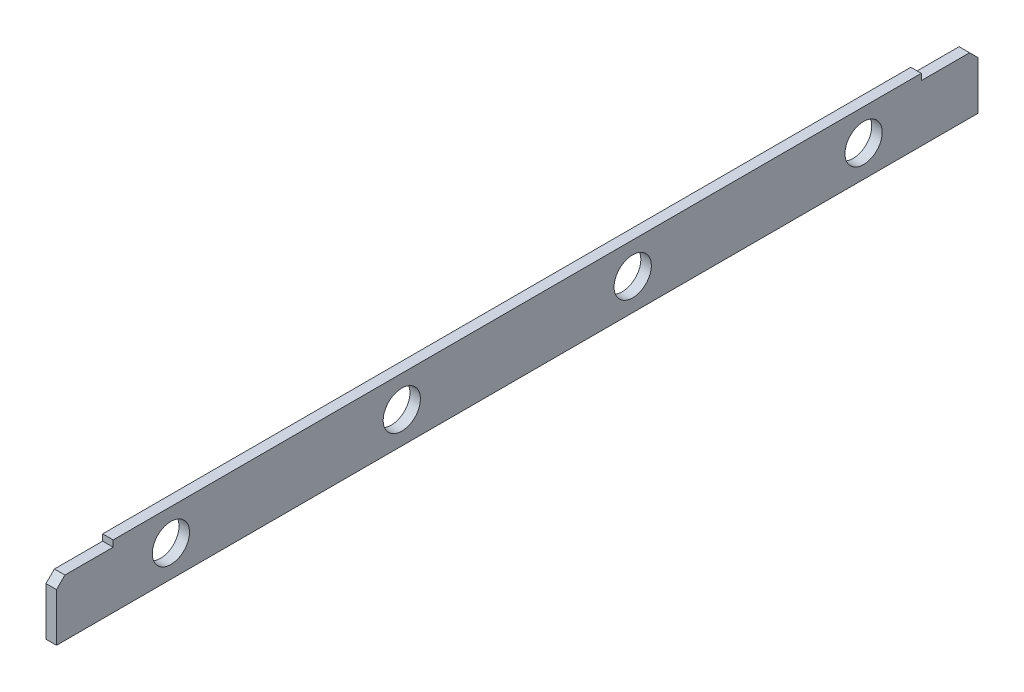
ISO-10303-21;
HEADER;
FILE_DESCRIPTION(('STEP AP214'),'2;1');
FILE_NAME('part.step','',(''),(''),'','','');
FILE_SCHEMA(('AUTOMOTIVE_DESIGN { 1 0 10303 214 1 1 1 1 }'));
ENDSEC;
DATA;
#1=APPLICATION_CONTEXT('core data for automotive mechanical design processes');
#2=APPLICATION_PROTOCOL_DEFINITION('international standard','automotive_design',2000,#1);
#3=PRODUCT_CONTEXT('',#1,'mechanical');
#4=PRODUCT('Part','Part','',(#3));
#5=PRODUCT_RELATED_PRODUCT_CATEGORY('part','',(#4));
#6=PRODUCT_DEFINITION_FORMATION('','',#4);
#7=PRODUCT_DEFINITION_CONTEXT('part definition',#1,'design');
#8=PRODUCT_DEFINITION('design','',#6,#7);
#9=PRODUCT_DEFINITION_SHAPE('','',#8);
#10=(LENGTH_UNIT() NAMED_UNIT(*) SI_UNIT(.MILLI.,.METRE.));
#11=(NAMED_UNIT(*) PLANE_ANGLE_UNIT() SI_UNIT($,.RADIAN.));
#12=(NAMED_UNIT(*) SI_UNIT($,.STERADIAN.) SOLID_ANGLE_UNIT());
#13=UNCERTAINTY_MEASURE_WITH_UNIT(LENGTH_MEASURE(1.E-05),#10,'distance_accuracy_value','');
#14=(GEOMETRIC_REPRESENTATION_CONTEXT(3) GLOBAL_UNCERTAINTY_ASSIGNED_CONTEXT((#13)) GLOBAL_UNIT_ASSIGNED_CONTEXT((#10,
#11,#12)) REPRESENTATION_CONTEXT('',''));
#15=CARTESIAN_POINT('',(0.,0.,0.));
#16=DIRECTION('',(0.,0.,1.));
#17=DIRECTION('',(1.,0.,0.));
#18=AXIS2_PLACEMENT_3D('',#15,#16,#17);
#19=CARTESIAN_POINT('',(0.,-60.0000000000011,445.));
#20=DIRECTION('',(1.,0.,0.));
#21=DIRECTION('',(0.,0.,-1.));
#22=AXIS2_PLACEMENT_3D('',#19,#20,#21);
#23=PLANE('',#22);
#24=CARTESIAN_POINT('',(0.,-30.0000000000142,330.));
#25=DIRECTION('',(1.,0.,0.));
#26=DIRECTION('',(0.,0.,-1.));
#27=AXIS2_PLACEMENT_3D('',#24,#25,#26);
#28=CIRCLE('',#27,17.75);
#29=CARTESIAN_POINT('',(0.,-30.0000000000142,312.25));
#30=VERTEX_POINT('',#29);
#31=EDGE_CURVE('E187',#30,#30,#28,.T.);
#32=ORIENTED_EDGE('',*,*,#31,.T.);
#33=EDGE_LOOP('',(#32));
#34=FACE_BOUND('',#33,.T.);
#35=CARTESIAN_POINT('',(0.,-30.0000000000142,110.));
#36=DIRECTION('',(1.,0.,0.));
#37=DIRECTION('',(0.,0.,-1.));
#38=AXIS2_PLACEMENT_3D('',#35,#36,#37);
#39=CIRCLE('',#38,17.75);
#40=CARTESIAN_POINT('',(0.,-30.0000000000142,92.2499999999998));
#41=VERTEX_POINT('',#40);
#42=EDGE_CURVE('E183',#41,#41,#39,.T.);
#43=ORIENTED_EDGE('',*,*,#42,.T.);
#44=EDGE_LOOP('',(#43));
#45=FACE_BOUND('',#44,.T.);
#46=CARTESIAN_POINT('',(0.,-30.000000000014,-110.));
#47=DIRECTION('',(1.,0.,0.));
#48=DIRECTION('',(0.,0.,-1.));
#49=AXIS2_PLACEMENT_3D('',#46,#47,#48);
#50=CIRCLE('',#49,17.75);
#51=CARTESIAN_POINT('',(0.,-30.000000000014,-127.75));
#52=VERTEX_POINT('',#51);
#53=EDGE_CURVE('E179',#52,#52,#50,.T.);
#54=ORIENTED_EDGE('',*,*,#53,.T.);
#55=EDGE_LOOP('',(#54));
#56=FACE_BOUND('',#55,.T.);
#57=CARTESIAN_POINT('',(-1.07552855510562E-13,-30.0000000000145,-330.000000000001));
#58=DIRECTION('',(1.,0.,0.));
#59=DIRECTION('',(0.,0.,-1.));
#60=AXIS2_PLACEMENT_3D('',#57,#58,#59);
#61=CIRCLE('',#60,17.75);
#62=CARTESIAN_POINT('',(-1.09511055020338E-13,-30.0000000000145,-347.750000000001));
#63=VERTEX_POINT('',#62);
#64=EDGE_CURVE('E178',#63,#63,#61,.T.);
#65=ORIENTED_EDGE('',*,*,#64,.T.);
#66=EDGE_LOOP('',(#65));
#67=FACE_BOUND('',#66,.T.);
#68=DIRECTION('',(0.,1.,0.));
#69=VECTOR('',#68,1.);
#70=CARTESIAN_POINT('',(0.,-60.0000000000093,-439.));
#71=LINE('',#70,#69);
#72=CARTESIAN_POINT('',(-3.38271077815477E-12,-60.0000000000002,-438.999999999999));
#73=VERTEX_POINT('',#72);
#74=CARTESIAN_POINT('',(0.,-13.9999999999999,-439.));
#75=VERTEX_POINT('',#74);
#76=EDGE_CURVE('E129',#73,#75,#71,.T.);
#77=ORIENTED_EDGE('',*,*,#76,.F.);
#78=DIRECTION('',(0.,0.,-1.));
#79=VECTOR('',#78,1.);
#80=CARTESIAN_POINT('',(0.,-60.0000000000011,445.));
#81=LINE('',#80,#79);
#82=CARTESIAN_POINT('',(0.,-60.0000000000003,439.000000000002));
#83=VERTEX_POINT('',#82);
#84=EDGE_CURVE('E159',#83,#73,#81,.T.);
#85=ORIENTED_EDGE('',*,*,#84,.F.);
#86=DIRECTION('',(0.,-0.999999999999999,0.));
#87=VECTOR('',#86,1.);
#88=CARTESIAN_POINT('',(0.,-60.0000000000012,439.000000000001));
#89=LINE('',#88,#87);
#90=CARTESIAN_POINT('',(0.,-14.0000000000001,439.));
#91=VERTEX_POINT('',#90);
#92=EDGE_CURVE('E213',#91,#83,#89,.T.);
#93=ORIENTED_EDGE('',*,*,#92,.F.);
#94=DIRECTION('',(0.,0.707106781186543,-0.707106781186552));
#95=VECTOR('',#94,1.);
#96=CARTESIAN_POINT('',(0.,-40.0000000000008,465.000000000001));
#97=LINE('',#96,#95);
#98=CARTESIAN_POINT('',(0.,-6.00000000000012,431.));
#99=VERTEX_POINT('',#98);
#100=EDGE_CURVE('E169',#91,#99,#97,.T.);
#101=ORIENTED_EDGE('',*,*,#100,.T.);
#102=DIRECTION('',(0.,0.,1.));
#103=VECTOR('',#102,1.);
#104=CARTESIAN_POINT('',(0.,-6.00000000000001,445.));
#105=LINE('',#104,#103);
#106=CARTESIAN_POINT('',(0.,-6.000000000001,385.));
#107=VERTEX_POINT('',#106);
#108=EDGE_CURVE('E221',#107,#99,#105,.T.);
#109=ORIENTED_EDGE('',*,*,#108,.F.);
#110=DIRECTION('',(0.,-0.999999999999999,0.));
#111=VECTOR('',#110,1.);
#112=CARTESIAN_POINT('',(0.,-60.0000000000015,385.000000000001));
#113=LINE('',#112,#111);
#114=CARTESIAN_POINT('',(0.,0.,385.));
#115=VERTEX_POINT('',#114);
#116=EDGE_CURVE('E225',#115,#107,#113,.T.);
#117=ORIENTED_EDGE('',*,*,#116,.F.);
#118=DIRECTION('',(0.,0.,-1.));
#119=VECTOR('',#118,1.);
#120=CARTESIAN_POINT('',(0.,0.,445.));
#121=LINE('',#120,#119);
#122=CARTESIAN_POINT('',(-3.43822192938603E-12,6.66133814775094E-13,-385.));
#123=VERTEX_POINT('',#122);
#124=EDGE_CURVE('E164',#115,#123,#121,.T.);
#125=ORIENTED_EDGE('',*,*,#124,.T.);
#126=DIRECTION('',(0.,1.,0.));
#127=VECTOR('',#126,1.);
#128=CARTESIAN_POINT('',(0.,-60.0000000000241,-384.999999999999));
#129=LINE('',#128,#127);
#130=CARTESIAN_POINT('',(-1.07552855510562E-13,-6.00000000000001,-385.));
#131=VERTEX_POINT('',#130);
#132=EDGE_CURVE('E156',#131,#123,#129,.T.);
#133=ORIENTED_EDGE('',*,*,#132,.F.);
#134=DIRECTION('',(0.,0.,1.));
#135=VECTOR('',#134,1.);
#136=CARTESIAN_POINT('',(0.,-5.99999999999046,445.000000000001));
#137=LINE('',#136,#135);
#138=CARTESIAN_POINT('',(-1.11022302462516E-13,-5.99999999999989,-431.));
#139=VERTEX_POINT('',#138);
#140=EDGE_CURVE('E145',#139,#131,#137,.T.);
#141=ORIENTED_EDGE('',*,*,#140,.F.);
#142=DIRECTION('',(0.,-0.707106781186554,-0.70710678118654));
#143=VECTOR('',#142,1.);
#144=CARTESIAN_POINT('',(0.,404.999999999999,-20.0000000000096));
#145=LINE('',#144,#143);
#146=EDGE_CURVE('E168',#139,#75,#145,.T.);
#147=ORIENTED_EDGE('',*,*,#146,.T.);
#148=EDGE_LOOP('',(#77,#85,#93,#101,#109,#117,#125,#133,#141,#147));
#149=FACE_BOUND('',#148,.T.);
#150=ADVANCED_FACE('F40',(#34,#45,#56,#67,#149),#23,.F.);
#151=CARTESIAN_POINT('',(0.,0.,445.));
#152=DIRECTION('',(0.,-0.999999999999999,0.));
#153=DIRECTION('',(0.,0.,-0.999999999999999));
#154=AXIS2_PLACEMENT_3D('',#151,#152,#153);
#155=PLANE('',#154);
#156=DIRECTION('',(1.,0.,0.));
#157=VECTOR('',#156,1.);
#158=CARTESIAN_POINT('',(-600.,1.22124532708767E-12,-385.));
#159=LINE('',#158,#157);
#160=CARTESIAN_POINT('',(9.9999999999999,6.66133814775094E-13,-385.));
#161=VERTEX_POINT('',#160);
#162=EDGE_CURVE('E152',#123,#161,#159,.T.);
#163=ORIENTED_EDGE('',*,*,#162,.F.);
#164=ORIENTED_EDGE('',*,*,#124,.F.);
#165=DIRECTION('',(1.,0.,0.));
#166=VECTOR('',#165,1.);
#167=CARTESIAN_POINT('',(-600.,-3.33066907387547E-13,385.));
#168=LINE('',#167,#166);
#169=CARTESIAN_POINT('',(10.0000000000005,-5.55111512312578E-13,384.999999999999));
#170=VERTEX_POINT('',#169);
#171=EDGE_CURVE('E163',#115,#170,#168,.T.);
#172=ORIENTED_EDGE('',*,*,#171,.T.);
#173=DIRECTION('',(0.,0.,-1.));
#174=VECTOR('',#173,1.);
#175=CARTESIAN_POINT('',(10.,-1.11022302462516E-13,445.));
#176=LINE('',#175,#174);
#177=EDGE_CURVE('E126',#170,#161,#176,.T.);
#178=ORIENTED_EDGE('',*,*,#177,.T.);
#179=EDGE_LOOP('',(#163,#164,#172,#178));
#180=FACE_BOUND('',#179,.T.);
#181=ADVANCED_FACE('F269',(#180),#155,.F.);
#182=CARTESIAN_POINT('',(9.99999999999995,-60.0000000000009,445.));
#183=DIRECTION('',(-1.,0.,0.));
#184=DIRECTION('',(0.,0.,1.));
#185=AXIS2_PLACEMENT_3D('',#182,#183,#184);
#186=PLANE('',#185);
#187=CARTESIAN_POINT('',(10.,-30.0000000000142,330.));
#188=DIRECTION('',(-1.,0.,0.));
#189=DIRECTION('',(0.,0.,1.));
#190=AXIS2_PLACEMENT_3D('',#187,#188,#189);
#191=CIRCLE('',#190,17.75);
#192=CARTESIAN_POINT('',(10.,-30.0000000000142,347.75));
#193=VERTEX_POINT('',#192);
#194=EDGE_CURVE('E43',#193,#193,#191,.T.);
#195=ORIENTED_EDGE('',*,*,#194,.T.);
#196=EDGE_LOOP('',(#195));
#197=FACE_BOUND('',#196,.T.);
#198=CARTESIAN_POINT('',(10.,-30.0000000000147,110.));
#199=DIRECTION('',(-1.,0.,0.));
#200=DIRECTION('',(0.,0.,1.));
#201=AXIS2_PLACEMENT_3D('',#198,#199,#200);
#202=CIRCLE('',#201,17.75);
#203=CARTESIAN_POINT('',(10.,-30.0000000000147,127.75));
#204=VERTEX_POINT('',#203);
#205=EDGE_CURVE('E184',#204,#204,#202,.T.);
#206=ORIENTED_EDGE('',*,*,#205,.T.);
#207=EDGE_LOOP('',(#206));
#208=FACE_BOUND('',#207,.T.);
#209=CARTESIAN_POINT('',(9.9999999999999,-30.0000000000141,-110.));
#210=DIRECTION('',(-1.,0.,0.));
#211=DIRECTION('',(0.,0.,1.));
#212=AXIS2_PLACEMENT_3D('',#209,#210,#211);
#213=CIRCLE('',#212,17.75);
#214=CARTESIAN_POINT('',(9.9999999999999,-30.0000000000141,-92.2500000000003));
#215=VERTEX_POINT('',#214);
#216=EDGE_CURVE('E180',#215,#215,#213,.T.);
#217=ORIENTED_EDGE('',*,*,#216,.T.);
#218=EDGE_LOOP('',(#217));
#219=FACE_BOUND('',#218,.T.);
#220=CARTESIAN_POINT('',(9.9999999999999,-30.0000000000145,-330.000000000001));
#221=DIRECTION('',(-1.,0.,0.));
#222=DIRECTION('',(0.,0.,1.));
#223=AXIS2_PLACEMENT_3D('',#220,#221,#222);
#224=CIRCLE('',#223,17.75);
#225=CARTESIAN_POINT('',(9.9999999999999,-30.0000000000145,-312.250000000001));
#226=VERTEX_POINT('',#225);
#227=EDGE_CURVE('E174',#226,#226,#224,.T.);
#228=ORIENTED_EDGE('',*,*,#227,.T.);
#229=EDGE_LOOP('',(#228));
#230=FACE_BOUND('',#229,.T.);
#231=DIRECTION('',(0.,-1.,0.));
#232=VECTOR('',#231,1.);
#233=CARTESIAN_POINT('',(9.99999999999985,-60.0000000000098,-439.));
#234=LINE('',#233,#232);
#235=CARTESIAN_POINT('',(9.9999999999999,-13.9999999999999,-439.));
#236=VERTEX_POINT('',#235);
#237=CARTESIAN_POINT('',(9.9999999999999,-60.0000000000017,-439.));
#238=VERTEX_POINT('',#237);
#239=EDGE_CURVE('E49',#236,#238,#234,.T.);
#240=ORIENTED_EDGE('',*,*,#239,.F.);
#241=DIRECTION('',(0.,0.707106781186554,0.70710678118654));
#242=VECTOR('',#241,1.);
#243=CARTESIAN_POINT('',(9.99999999999993,404.999999999999,-20.0000000000095));
#244=LINE('',#243,#242);
#245=CARTESIAN_POINT('',(9.9999999999999,-5.99999999999989,-431.));
#246=VERTEX_POINT('',#245);
#247=EDGE_CURVE('E116',#236,#246,#244,.T.);
#248=ORIENTED_EDGE('',*,*,#247,.T.);
#249=DIRECTION('',(0.,0.,-1.));
#250=VECTOR('',#249,1.);
#251=CARTESIAN_POINT('',(10.,-5.99999999999046,444.999999999999));
#252=LINE('',#251,#250);
#253=CARTESIAN_POINT('',(9.99999999999993,-5.99999999999989,-385.));
#254=VERTEX_POINT('',#253);
#255=EDGE_CURVE('E151',#254,#246,#252,.T.);
#256=ORIENTED_EDGE('',*,*,#255,.F.);
#257=DIRECTION('',(0.,-1.,0.));
#258=VECTOR('',#257,1.);
#259=CARTESIAN_POINT('',(10.,-60.0000000000241,-384.999999999998));
#260=LINE('',#259,#258);
#261=EDGE_CURVE('E155',#161,#254,#260,.T.);
#262=ORIENTED_EDGE('',*,*,#261,.F.);
#263=ORIENTED_EDGE('',*,*,#177,.F.);
#264=DIRECTION('',(0.,0.999999999999999,0.));
#265=VECTOR('',#264,1.);
#266=CARTESIAN_POINT('',(9.99999999999997,-60.0000000000016,385.));
#267=LINE('',#266,#265);
#268=CARTESIAN_POINT('',(9.99999999999998,-6.000000000001,385.));
#269=VERTEX_POINT('',#268);
#270=EDGE_CURVE('E173',#269,#170,#267,.T.);
#271=ORIENTED_EDGE('',*,*,#270,.F.);
#272=DIRECTION('',(0.,0.,-1.));
#273=VECTOR('',#272,1.);
#274=CARTESIAN_POINT('',(10.,-6.00000000000001,445.));
#275=LINE('',#274,#273);
#276=CARTESIAN_POINT('',(9.99999999999998,-6.00000000000023,430.999999999999));
#277=VERTEX_POINT('',#276);
#278=EDGE_CURVE('E224',#277,#269,#275,.T.);
#279=ORIENTED_EDGE('',*,*,#278,.F.);
#280=DIRECTION('',(0.,-0.707106781186543,0.707106781186552));
#281=VECTOR('',#280,1.);
#282=CARTESIAN_POINT('',(9.99999999999999,-40.0000000000008,465.000000000001));
#283=LINE('',#282,#281);
#284=CARTESIAN_POINT('',(9.99999999999998,-14.0000000000001,439.));
#285=VERTEX_POINT('',#284);
#286=EDGE_CURVE('E125',#277,#285,#283,.T.);
#287=ORIENTED_EDGE('',*,*,#286,.T.);
#288=DIRECTION('',(0.,0.999999999999999,0.));
#289=VECTOR('',#288,1.);
#290=CARTESIAN_POINT('',(9.99999999999997,-60.0000000000013,439.000000000001));
#291=LINE('',#290,#289);
#292=CARTESIAN_POINT('',(9.99999999999999,-60.0000000000004,439.000000000001));
#293=VERTEX_POINT('',#292);
#294=EDGE_CURVE('E217',#293,#285,#291,.T.);
#295=ORIENTED_EDGE('',*,*,#294,.F.);
#296=DIRECTION('',(0.,0.,-1.));
#297=VECTOR('',#296,1.);
#298=CARTESIAN_POINT('',(9.99999999999995,-60.0000000000009,445.));
#299=LINE('',#298,#297);
#300=EDGE_CURVE('E136',#293,#238,#299,.T.);
#301=ORIENTED_EDGE('',*,*,#300,.T.);
#302=EDGE_LOOP('',(#240,#248,#256,#262,#263,#271,#279,#287,#295,#301));
#303=FACE_BOUND('',#302,.T.);
#304=ADVANCED_FACE('F133',(#197,#208,#219,#230,#303),#186,.F.);
#305=CARTESIAN_POINT('',(9.99999999999995,-60.0000000000009,445.));
#306=DIRECTION('',(0.,0.999999999999999,0.));
#307=DIRECTION('',(0.,0.,0.999999999999999));
#308=AXIS2_PLACEMENT_3D('',#305,#306,#307);
#309=PLANE('',#308);
#310=DIRECTION('',(-1.,0.,0.));
#311=VECTOR('',#310,1.);
#312=CARTESIAN_POINT('',(9.9999999999999,-60.0000000000017,-439.));
#313=LINE('',#312,#311);
#314=EDGE_CURVE('E11',#238,#73,#313,.T.);
#315=ORIENTED_EDGE('',*,*,#314,.F.);
#316=ORIENTED_EDGE('',*,*,#300,.F.);
#317=DIRECTION('',(1.,0.,0.));
#318=VECTOR('',#317,1.);
#319=CARTESIAN_POINT('',(-600.,-60.0000000000003,439.));
#320=LINE('',#319,#318);
#321=EDGE_CURVE('E216',#83,#293,#320,.T.);
#322=ORIENTED_EDGE('',*,*,#321,.F.);
#323=ORIENTED_EDGE('',*,*,#84,.T.);
#324=EDGE_LOOP('',(#315,#316,#322,#323));
#325=FACE_BOUND('',#324,.T.);
#326=ADVANCED_FACE('F287',(#325),#309,.F.);
#327=CARTESIAN_POINT('',(-600.,-2.00000000000033,385.));
#328=DIRECTION('',(0.,0.,1.));
#329=DIRECTION('',(0.,-0.999999999999999,0.));
#330=AXIS2_PLACEMENT_3D('',#327,#328,#329);
#331=PLANE('',#330);
#332=ORIENTED_EDGE('',*,*,#270,.T.);
#333=ORIENTED_EDGE('',*,*,#171,.F.);
#334=ORIENTED_EDGE('',*,*,#116,.T.);
#335=DIRECTION('',(1.,0.,0.));
#336=VECTOR('',#335,1.);
#337=CARTESIAN_POINT('',(-600.,-6.00000000000056,385.));
#338=LINE('',#337,#336);
#339=EDGE_CURVE('E228',#107,#269,#338,.T.);
#340=ORIENTED_EDGE('',*,*,#339,.T.);
#341=EDGE_LOOP('',(#332,#333,#334,#340));
#342=FACE_BOUND('',#341,.T.);
#343=ADVANCED_FACE('F275',(#342),#331,.T.);
#344=CARTESIAN_POINT('',(-600.,-56.,439.000000000001));
#345=DIRECTION('',(0.,0.,1.));
#346=DIRECTION('',(0.,-0.999999999999999,0.));
#347=AXIS2_PLACEMENT_3D('',#344,#345,#346);
#348=PLANE('',#347);
#349=ORIENTED_EDGE('',*,*,#294,.T.);
#350=DIRECTION('',(1.,0.,0.));
#351=VECTOR('',#350,1.);
#352=CARTESIAN_POINT('',(-600.,-14.,439.));
#353=LINE('',#352,#351);
#354=EDGE_CURVE('E231',#91,#285,#353,.T.);
#355=ORIENTED_EDGE('',*,*,#354,.F.);
#356=ORIENTED_EDGE('',*,*,#92,.T.);
#357=ORIENTED_EDGE('',*,*,#321,.T.);
#358=EDGE_LOOP('',(#349,#355,#356,#357));
#359=FACE_BOUND('',#358,.T.);
#360=ADVANCED_FACE('F289',(#359),#348,.T.);
#361=CARTESIAN_POINT('',(-600.,-14.,439.));
#362=DIRECTION('',(0.,-0.707106781186552,-0.707106781186543));
#363=DIRECTION('',(0.,0.707106781186543,-0.707106781186552));
#364=AXIS2_PLACEMENT_3D('',#361,#362,#363);
#365=PLANE('',#364);
#366=DIRECTION('',(1.,0.,0.));
#367=VECTOR('',#366,1.);
#368=CARTESIAN_POINT('',(-599.999999999999,-6.00000000000078,431.));
#369=LINE('',#368,#367);
#370=EDGE_CURVE('E146',#99,#277,#369,.T.);
#371=ORIENTED_EDGE('',*,*,#370,.F.);
#372=ORIENTED_EDGE('',*,*,#100,.F.);
#373=ORIENTED_EDGE('',*,*,#354,.T.);
#374=ORIENTED_EDGE('',*,*,#286,.F.);
#375=EDGE_LOOP('',(#371,#372,#373,#374));
#376=FACE_BOUND('',#375,.T.);
#377=ADVANCED_FACE('F292',(#376),#365,.F.);
#378=CARTESIAN_POINT('',(-599.999999999999,-6.00000000000078,431.));
#379=DIRECTION('',(0.,0.999999999999999,0.));
#380=DIRECTION('',(0.,0.,0.999999999999999));
#381=AXIS2_PLACEMENT_3D('',#378,#379,#380);
#382=PLANE('',#381);
#383=ORIENTED_EDGE('',*,*,#278,.T.);
#384=ORIENTED_EDGE('',*,*,#339,.F.);
#385=ORIENTED_EDGE('',*,*,#108,.T.);
#386=ORIENTED_EDGE('',*,*,#370,.T.);
#387=EDGE_LOOP('',(#383,#384,#385,#386));
#388=FACE_BOUND('',#387,.T.);
#389=ADVANCED_FACE('F278',(#388),#382,.T.);
#390=CARTESIAN_POINT('',(-600.,-6.00000000000056,-431.));
#391=DIRECTION('',(0.,-0.70710678118654,0.707106781186554));
#392=DIRECTION('',(0.,-0.707106781186554,-0.70710678118654));
#393=AXIS2_PLACEMENT_3D('',#390,#391,#392);
#394=PLANE('',#393);
#395=DIRECTION('',(1.,0.,0.));
#396=VECTOR('',#395,1.);
#397=CARTESIAN_POINT('',(-600.,-6.00000000000056,-431.));
#398=LINE('',#397,#396);
#399=EDGE_CURVE('E121',#139,#246,#398,.T.);
#400=ORIENTED_EDGE('',*,*,#399,.T.);
#401=ORIENTED_EDGE('',*,*,#247,.F.);
#402=DIRECTION('',(1.,0.,0.));
#403=VECTOR('',#402,1.);
#404=CARTESIAN_POINT('',(-599.999999999999,-14.,-439.));
#405=LINE('',#404,#403);
#406=EDGE_CURVE('E118',#75,#236,#405,.T.);
#407=ORIENTED_EDGE('',*,*,#406,.F.);
#408=ORIENTED_EDGE('',*,*,#146,.F.);
#409=EDGE_LOOP('',(#400,#401,#407,#408));
#410=FACE_BOUND('',#409,.T.);
#411=ADVANCED_FACE('F117',(#410),#394,.F.);
#412=CARTESIAN_POINT('',(-600.,-5.99999999999934,-389.));
#413=DIRECTION('',(0.,0.999999999999999,0.));
#414=DIRECTION('',(0.,0.,1.));
#415=AXIS2_PLACEMENT_3D('',#412,#413,#414);
#416=PLANE('',#415);
#417=ORIENTED_EDGE('',*,*,#140,.T.);
#418=DIRECTION('',(1.,0.,0.));
#419=VECTOR('',#418,1.);
#420=CARTESIAN_POINT('',(-600.,-5.99999999999934,-385.));
#421=LINE('',#420,#419);
#422=EDGE_CURVE('E147',#131,#254,#421,.T.);
#423=ORIENTED_EDGE('',*,*,#422,.T.);
#424=ORIENTED_EDGE('',*,*,#255,.T.);
#425=ORIENTED_EDGE('',*,*,#399,.F.);
#426=EDGE_LOOP('',(#417,#423,#424,#425));
#427=FACE_BOUND('',#426,.T.);
#428=ADVANCED_FACE('F282',(#427),#416,.T.);
#429=CARTESIAN_POINT('',(-600.,1.22124532708767E-12,-385.));
#430=DIRECTION('',(0.,0.,-1.));
#431=DIRECTION('',(0.,1.,0.));
#432=AXIS2_PLACEMENT_3D('',#429,#430,#431);
#433=PLANE('',#432);
#434=ORIENTED_EDGE('',*,*,#132,.T.);
#435=ORIENTED_EDGE('',*,*,#162,.T.);
#436=ORIENTED_EDGE('',*,*,#261,.T.);
#437=ORIENTED_EDGE('',*,*,#422,.F.);
#438=EDGE_LOOP('',(#434,#435,#436,#437));
#439=FACE_BOUND('',#438,.T.);
#440=ADVANCED_FACE('F263',(#439),#433,.T.);
#441=CARTESIAN_POINT('',(-599.999999999999,-14.,-439.));
#442=DIRECTION('',(0.,0.,-1.));
#443=DIRECTION('',(0.,1.,0.));
#444=AXIS2_PLACEMENT_3D('',#441,#442,#443);
#445=PLANE('',#444);
#446=ORIENTED_EDGE('',*,*,#76,.T.);
#447=ORIENTED_EDGE('',*,*,#406,.T.);
#448=ORIENTED_EDGE('',*,*,#239,.T.);
#449=ORIENTED_EDGE('',*,*,#314,.T.);
#450=EDGE_LOOP('',(#446,#447,#448,#449));
#451=FACE_BOUND('',#450,.T.);
#452=ADVANCED_FACE('F128',(#451),#445,.T.);
#453=CARTESIAN_POINT('',(610.,-30.0000000000146,-330.000000000001));
#454=DIRECTION('',(-1.,0.,0.));
#455=DIRECTION('',(0.,0.,1.));
#456=AXIS2_PLACEMENT_3D('',#453,#454,#455);
#457=CYLINDRICAL_SURFACE('',#456,17.75);
#458=ORIENTED_EDGE('',*,*,#227,.F.);
#459=EDGE_LOOP('',(#458));
#460=FACE_BOUND('',#459,.T.);
#461=ORIENTED_EDGE('',*,*,#64,.F.);
#462=EDGE_LOOP('',(#461));
#463=FACE_BOUND('',#462,.T.);
#464=ADVANCED_FACE('F312',(#460,#463),#457,.F.);
#465=CARTESIAN_POINT('',(610.,-30.0000000000146,-110.000000000001));
#466=DIRECTION('',(-1.,0.,0.));
#467=DIRECTION('',(0.,0.,1.));
#468=AXIS2_PLACEMENT_3D('',#465,#466,#467);
#469=CYLINDRICAL_SURFACE('',#468,17.75);
#470=ORIENTED_EDGE('',*,*,#216,.F.);
#471=EDGE_LOOP('',(#470));
#472=FACE_BOUND('',#471,.T.);
#473=ORIENTED_EDGE('',*,*,#53,.F.);
#474=EDGE_LOOP('',(#473));
#475=FACE_BOUND('',#474,.T.);
#476=ADVANCED_FACE('F314',(#472,#475),#469,.F.);
#477=CARTESIAN_POINT('',(610.000000000001,-30.0000000000147,109.999999999999));
#478=DIRECTION('',(-1.,0.,0.));
#479=DIRECTION('',(0.,0.,1.));
#480=AXIS2_PLACEMENT_3D('',#477,#478,#479);
#481=CYLINDRICAL_SURFACE('',#480,17.75);
#482=ORIENTED_EDGE('',*,*,#205,.F.);
#483=EDGE_LOOP('',(#482));
#484=FACE_BOUND('',#483,.T.);
#485=ORIENTED_EDGE('',*,*,#42,.F.);
#486=EDGE_LOOP('',(#485));
#487=FACE_BOUND('',#486,.T.);
#488=ADVANCED_FACE('F321',(#484,#487),#481,.F.);
#489=CARTESIAN_POINT('',(610.,-30.000000000014,330.));
#490=DIRECTION('',(-1.,0.,0.));
#491=DIRECTION('',(0.,0.,1.));
#492=AXIS2_PLACEMENT_3D('',#489,#490,#491);
#493=CYLINDRICAL_SURFACE('',#492,17.75);
#494=ORIENTED_EDGE('',*,*,#194,.F.);
#495=EDGE_LOOP('',(#494));
#496=FACE_BOUND('',#495,.T.);
#497=ORIENTED_EDGE('',*,*,#31,.F.);
#498=EDGE_LOOP('',(#497));
#499=FACE_BOUND('',#498,.T.);
#500=ADVANCED_FACE('F329',(#496,#499),#493,.F.);
#501=CLOSED_SHELL('',(#150,#181,#304,#326,#343,#360,#377,#389,#411,#428,#440,#452,#464,#476,
#488,#500));
#502=MANIFOLD_SOLID_BREP('B2',#501);
#503=ADVANCED_BREP_SHAPE_REPRESENTATION('',(#18,#502),#14);
#504=SHAPE_DEFINITION_REPRESENTATION(#9,#503);
ENDSEC;
END-ISO-10303-21;
